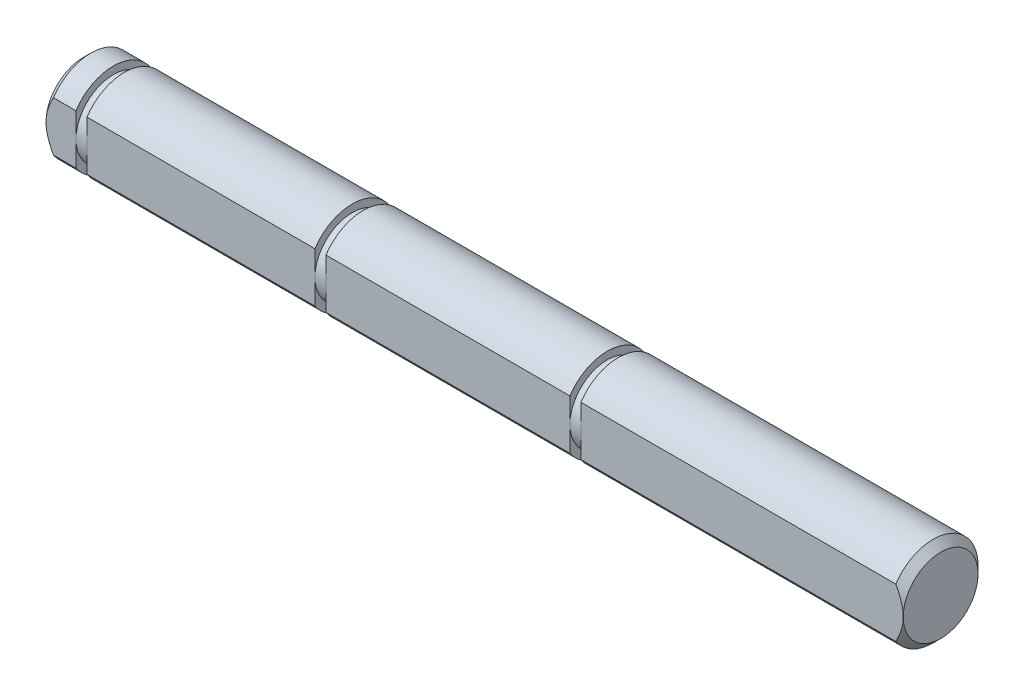
ISO-10303-21;
HEADER;
FILE_DESCRIPTION(('STEP AP214'),'2;1');
FILE_NAME('part.step','',(''),(''),'','','');
FILE_SCHEMA(('AUTOMOTIVE_DESIGN { 1 0 10303 214 1 1 1 1 }'));
ENDSEC;
DATA;
#1=APPLICATION_CONTEXT('core data for automotive mechanical design processes');
#2=APPLICATION_PROTOCOL_DEFINITION('international standard','automotive_design',2000,#1);
#3=PRODUCT_CONTEXT('',#1,'mechanical');
#4=PRODUCT('Part','Part','',(#3));
#5=PRODUCT_RELATED_PRODUCT_CATEGORY('part','',(#4));
#6=PRODUCT_DEFINITION_FORMATION('','',#4);
#7=PRODUCT_DEFINITION_CONTEXT('part definition',#1,'design');
#8=PRODUCT_DEFINITION('design','',#6,#7);
#9=PRODUCT_DEFINITION_SHAPE('','',#8);
#10=(LENGTH_UNIT() NAMED_UNIT(*) SI_UNIT(.MILLI.,.METRE.));
#11=(NAMED_UNIT(*) PLANE_ANGLE_UNIT() SI_UNIT($,.RADIAN.));
#12=(NAMED_UNIT(*) SI_UNIT($,.STERADIAN.) SOLID_ANGLE_UNIT());
#13=UNCERTAINTY_MEASURE_WITH_UNIT(LENGTH_MEASURE(1.E-05),#10,'distance_accuracy_value','');
#14=(GEOMETRIC_REPRESENTATION_CONTEXT(3) GLOBAL_UNCERTAINTY_ASSIGNED_CONTEXT((#13)) GLOBAL_UNIT_ASSIGNED_CONTEXT((#10,
#11,#12)) REPRESENTATION_CONTEXT('',''));
#15=CARTESIAN_POINT('',(0.,0.,0.));
#16=DIRECTION('',(0.,0.,1.));
#17=DIRECTION('',(1.,0.,0.));
#18=AXIS2_PLACEMENT_3D('',#15,#16,#17);
#19=CARTESIAN_POINT('',(-17.9666,0.,0.));
#20=DIRECTION('',(-1.,0.,0.));
#21=DIRECTION('',(0.,0.,1.));
#22=AXIS2_PLACEMENT_3D('',#19,#20,#21);
#23=PLANE('',#22);
#24=CARTESIAN_POINT('',(-17.9666,0.,0.));
#25=DIRECTION('',(-1.,0.,0.));
#26=DIRECTION('',(0.,0.,1.));
#27=AXIS2_PLACEMENT_3D('',#24,#25,#26);
#28=CIRCLE('',#27,2.5);
#29=CARTESIAN_POINT('',(-17.9666,0.,2.5));
#30=VERTEX_POINT('',#29);
#31=EDGE_CURVE('E135',#30,#30,#28,.T.);
#32=ORIENTED_EDGE('',*,*,#31,.T.);
#33=EDGE_LOOP('',(#32));
#34=FACE_BOUND('',#33,.T.);
#35=ADVANCED_FACE('F33',(#34),#23,.T.);
#36=CARTESIAN_POINT('',(-17.9666,0.,0.));
#37=DIRECTION('',(1.,0.,0.));
#38=DIRECTION('',(0.,0.,-1.));
#39=AXIS2_PLACEMENT_3D('',#36,#37,#38);
#40=CYLINDRICAL_SURFACE('',#39,3.);
#41=DIRECTION('',(1.,0.,0.));
#42=VECTOR('',#41,1.);
#43=CARTESIAN_POINT('',(-17.9666,1.6583123951777,2.5));
#44=LINE('',#43,#42);
#45=CARTESIAN_POINT('',(-15.9666,1.6583123951777,2.5));
#46=VERTEX_POINT('',#45);
#47=CARTESIAN_POINT('',(-17.4666,1.6583123951777,2.5));
#48=VERTEX_POINT('',#47);
#49=EDGE_CURVE('E144',#46,#48,#44,.F.);
#50=ORIENTED_EDGE('',*,*,#49,.F.);
#51=CARTESIAN_POINT('',(-15.9666,0.,0.));
#52=DIRECTION('',(1.,0.,0.));
#53=DIRECTION('',(0.,0.,-1.));
#54=AXIS2_PLACEMENT_3D('',#51,#52,#53);
#55=CIRCLE('',#54,3.);
#56=CARTESIAN_POINT('',(-15.9666,-1.6583123951777,2.5));
#57=VERTEX_POINT('',#56);
#58=EDGE_CURVE('E143',#57,#46,#55,.T.);
#59=ORIENTED_EDGE('',*,*,#58,.F.);
#60=DIRECTION('',(1.,0.,0.));
#61=VECTOR('',#60,1.);
#62=CARTESIAN_POINT('',(-17.9666,-1.6583123951777,2.5));
#63=LINE('',#62,#61);
#64=CARTESIAN_POINT('',(-17.4666,-1.6583123951777,2.5));
#65=VERTEX_POINT('',#64);
#66=EDGE_CURVE('E128',#65,#57,#63,.T.);
#67=ORIENTED_EDGE('',*,*,#66,.F.);
#68=CARTESIAN_POINT('',(-17.4666,0.,0.));
#69=DIRECTION('',(-1.,0.,0.));
#70=DIRECTION('',(0.,0.,1.));
#71=AXIS2_PLACEMENT_3D('',#68,#69,#70);
#72=CIRCLE('',#71,3.);
#73=EDGE_CURVE('E141',#65,#48,#72,.F.);
#74=ORIENTED_EDGE('',*,*,#73,.T.);
#75=EDGE_LOOP('',(#50,#59,#67,#74));
#76=FACE_BOUND('',#75,.T.);
#77=ADVANCED_FACE('F140',(#76),#40,.T.);
#78=CARTESIAN_POINT('',(-15.9666,3.,0.));
#79=DIRECTION('',(1.,0.,0.));
#80=DIRECTION('',(0.,0.,-1.));
#81=AXIS2_PLACEMENT_3D('',#78,#79,#80);
#82=PLANE('',#81);
#83=DIRECTION('',(0.,1.,0.));
#84=VECTOR('',#83,1.);
#85=CARTESIAN_POINT('',(-15.9666,3.,2.5));
#86=LINE('',#85,#84);
#87=CARTESIAN_POINT('',(-15.9666,0.,2.5));
#88=VERTEX_POINT('',#87);
#89=EDGE_CURVE('E421',#57,#88,#86,.T.);
#90=ORIENTED_EDGE('',*,*,#89,.F.);
#91=ORIENTED_EDGE('',*,*,#58,.T.);
#92=EDGE_CURVE('E423',#88,#46,#86,.T.);
#93=ORIENTED_EDGE('',*,*,#92,.F.);
#94=CARTESIAN_POINT('',(-15.9666,0.,0.));
#95=DIRECTION('',(1.,0.,0.));
#96=DIRECTION('',(0.,0.,-1.));
#97=AXIS2_PLACEMENT_3D('',#94,#95,#96);
#98=CIRCLE('',#97,2.5);
#99=EDGE_CURVE('E155',#88,#88,#98,.T.);
#100=ORIENTED_EDGE('',*,*,#99,.F.);
#101=EDGE_LOOP('',(#90,#91,#93,#100));
#102=FACE_BOUND('',#101,.T.);
#103=ADVANCED_FACE('F264',(#102),#82,.T.);
#104=CARTESIAN_POINT('',(-17.9666,0.,0.));
#105=DIRECTION('',(1.,0.,0.));
#106=DIRECTION('',(0.,0.,-1.));
#107=AXIS2_PLACEMENT_3D('',#104,#105,#106);
#108=CYLINDRICAL_SURFACE('',#107,2.5);
#109=ORIENTED_EDGE('',*,*,#99,.T.);
#110=EDGE_LOOP('',(#109));
#111=FACE_BOUND('',#110,.T.);
#112=CARTESIAN_POINT('',(-15.23,0.,0.));
#113=DIRECTION('',(1.,0.,0.));
#114=DIRECTION('',(0.,0.,-1.));
#115=AXIS2_PLACEMENT_3D('',#112,#113,#114);
#116=CIRCLE('',#115,2.5);
#117=CARTESIAN_POINT('',(-15.23,0.,2.5));
#118=VERTEX_POINT('',#117);
#119=EDGE_CURVE('E158',#118,#118,#116,.T.);
#120=ORIENTED_EDGE('',*,*,#119,.F.);
#121=EDGE_LOOP('',(#120));
#122=FACE_BOUND('',#121,.T.);
#123=ADVANCED_FACE('F260',(#111,#122),#108,.T.);
#124=CARTESIAN_POINT('',(-15.23,3.,0.));
#125=DIRECTION('',(-1.,0.,0.));
#126=DIRECTION('',(0.,0.,1.));
#127=AXIS2_PLACEMENT_3D('',#124,#125,#126);
#128=PLANE('',#127);
#129=DIRECTION('',(0.,-1.,0.));
#130=VECTOR('',#129,1.);
#131=CARTESIAN_POINT('',(-15.23,3.,2.5));
#132=LINE('',#131,#130);
#133=CARTESIAN_POINT('',(-15.23,1.6583123951777,2.5));
#134=VERTEX_POINT('',#133);
#135=EDGE_CURVE('E188',#134,#118,#132,.T.);
#136=ORIENTED_EDGE('',*,*,#135,.F.);
#137=CARTESIAN_POINT('',(-15.23,0.,0.));
#138=DIRECTION('',(1.,0.,0.));
#139=DIRECTION('',(0.,0.,-1.));
#140=AXIS2_PLACEMENT_3D('',#137,#138,#139);
#141=CIRCLE('',#140,3.);
#142=CARTESIAN_POINT('',(-15.23,-1.6583123951777,2.5));
#143=VERTEX_POINT('',#142);
#144=EDGE_CURVE('E161',#143,#134,#141,.T.);
#145=ORIENTED_EDGE('',*,*,#144,.F.);
#146=EDGE_CURVE('E414',#118,#143,#132,.T.);
#147=ORIENTED_EDGE('',*,*,#146,.F.);
#148=ORIENTED_EDGE('',*,*,#119,.T.);
#149=EDGE_LOOP('',(#136,#145,#147,#148));
#150=FACE_BOUND('',#149,.T.);
#151=ADVANCED_FACE('F256',(#150),#128,.T.);
#152=CARTESIAN_POINT('',(-17.9666,0.,0.));
#153=DIRECTION('',(1.,0.,0.));
#154=DIRECTION('',(0.,0.,-1.));
#155=AXIS2_PLACEMENT_3D('',#152,#153,#154);
#156=CYLINDRICAL_SURFACE('',#155,3.);
#157=DIRECTION('',(1.,0.,0.));
#158=VECTOR('',#157,1.);
#159=CARTESIAN_POINT('',(-17.9666,1.6583123951777,2.5));
#160=LINE('',#159,#158);
#161=CARTESIAN_POINT('',(0.,1.6583123951777,2.5));
#162=VERTEX_POINT('',#161);
#163=EDGE_CURVE('E189',#162,#134,#160,.F.);
#164=ORIENTED_EDGE('',*,*,#163,.F.);
#165=CARTESIAN_POINT('',(0.,0.,0.));
#166=DIRECTION('',(1.,0.,0.));
#167=DIRECTION('',(0.,0.,-1.));
#168=AXIS2_PLACEMENT_3D('',#165,#166,#167);
#169=CIRCLE('',#168,3.);
#170=CARTESIAN_POINT('',(0.,-1.6583123951777,2.5));
#171=VERTEX_POINT('',#170);
#172=EDGE_CURVE('E164',#171,#162,#169,.T.);
#173=ORIENTED_EDGE('',*,*,#172,.F.);
#174=DIRECTION('',(1.,0.,0.));
#175=VECTOR('',#174,1.);
#176=CARTESIAN_POINT('',(-17.9666,-1.6583123951777,2.5));
#177=LINE('',#176,#175);
#178=EDGE_CURVE('E420',#143,#171,#177,.T.);
#179=ORIENTED_EDGE('',*,*,#178,.F.);
#180=ORIENTED_EDGE('',*,*,#144,.T.);
#181=EDGE_LOOP('',(#164,#173,#179,#180));
#182=FACE_BOUND('',#181,.T.);
#183=ADVANCED_FACE('F252',(#182),#156,.T.);
#184=CARTESIAN_POINT('',(0.,3.,0.));
#185=DIRECTION('',(1.,0.,0.));
#186=DIRECTION('',(0.,0.,-1.));
#187=AXIS2_PLACEMENT_3D('',#184,#185,#186);
#188=PLANE('',#187);
#189=DIRECTION('',(0.,1.,0.));
#190=VECTOR('',#189,1.);
#191=CARTESIAN_POINT('',(0.,3.,2.5));
#192=LINE('',#191,#190);
#193=CARTESIAN_POINT('',(0.,0.,2.5));
#194=VERTEX_POINT('',#193);
#195=EDGE_CURVE('E54',#171,#194,#192,.T.);
#196=ORIENTED_EDGE('',*,*,#195,.F.);
#197=ORIENTED_EDGE('',*,*,#172,.T.);
#198=EDGE_CURVE('E191',#194,#162,#192,.T.);
#199=ORIENTED_EDGE('',*,*,#198,.F.);
#200=CARTESIAN_POINT('',(0.,0.,0.));
#201=DIRECTION('',(1.,0.,0.));
#202=DIRECTION('',(0.,0.,-1.));
#203=AXIS2_PLACEMENT_3D('',#200,#201,#202);
#204=CIRCLE('',#203,2.5);
#205=EDGE_CURVE('E167',#194,#194,#204,.T.);
#206=ORIENTED_EDGE('',*,*,#205,.F.);
#207=EDGE_LOOP('',(#196,#197,#199,#206));
#208=FACE_BOUND('',#207,.T.);
#209=ADVANCED_FACE('F248',(#208),#188,.T.);
#210=CARTESIAN_POINT('',(-17.9666,0.,0.));
#211=DIRECTION('',(1.,0.,0.));
#212=DIRECTION('',(0.,0.,-1.));
#213=AXIS2_PLACEMENT_3D('',#210,#211,#212);
#214=CYLINDRICAL_SURFACE('',#213,2.5);
#215=ORIENTED_EDGE('',*,*,#205,.T.);
#216=EDGE_LOOP('',(#215));
#217=FACE_BOUND('',#216,.T.);
#218=CARTESIAN_POINT('',(0.7366,0.,0.));
#219=DIRECTION('',(1.,0.,0.));
#220=DIRECTION('',(0.,0.,-1.));
#221=AXIS2_PLACEMENT_3D('',#218,#219,#220);
#222=CIRCLE('',#221,2.5);
#223=CARTESIAN_POINT('',(0.7366,0.,2.5));
#224=VERTEX_POINT('',#223);
#225=EDGE_CURVE('E170',#224,#224,#222,.T.);
#226=ORIENTED_EDGE('',*,*,#225,.F.);
#227=EDGE_LOOP('',(#226));
#228=FACE_BOUND('',#227,.T.);
#229=ADVANCED_FACE('F244',(#217,#228),#214,.T.);
#230=CARTESIAN_POINT('',(0.7366,3.,0.));
#231=DIRECTION('',(-1.,0.,0.));
#232=DIRECTION('',(0.,0.,1.));
#233=AXIS2_PLACEMENT_3D('',#230,#231,#232);
#234=PLANE('',#233);
#235=DIRECTION('',(0.,-1.,0.));
#236=VECTOR('',#235,1.);
#237=CARTESIAN_POINT('',(0.7366,3.,2.5));
#238=LINE('',#237,#236);
#239=CARTESIAN_POINT('',(0.7366,1.6583123951777,2.5));
#240=VERTEX_POINT('',#239);
#241=EDGE_CURVE('E194',#240,#224,#238,.T.);
#242=ORIENTED_EDGE('',*,*,#241,.F.);
#243=CARTESIAN_POINT('',(0.7366,0.,0.));
#244=DIRECTION('',(1.,0.,0.));
#245=DIRECTION('',(0.,0.,-1.));
#246=AXIS2_PLACEMENT_3D('',#243,#244,#245);
#247=CIRCLE('',#246,3.);
#248=CARTESIAN_POINT('',(0.7366,-1.6583123951777,2.5));
#249=VERTEX_POINT('',#248);
#250=EDGE_CURVE('E173',#249,#240,#247,.T.);
#251=ORIENTED_EDGE('',*,*,#250,.F.);
#252=EDGE_CURVE('E428',#224,#249,#238,.T.);
#253=ORIENTED_EDGE('',*,*,#252,.F.);
#254=ORIENTED_EDGE('',*,*,#225,.T.);
#255=EDGE_LOOP('',(#242,#251,#253,#254));
#256=FACE_BOUND('',#255,.T.);
#257=ADVANCED_FACE('F240',(#256),#234,.T.);
#258=CARTESIAN_POINT('',(-17.9666,0.,0.));
#259=DIRECTION('',(1.,0.,0.));
#260=DIRECTION('',(0.,0.,-1.));
#261=AXIS2_PLACEMENT_3D('',#258,#259,#260);
#262=CYLINDRICAL_SURFACE('',#261,3.);
#263=DIRECTION('',(1.,0.,0.));
#264=VECTOR('',#263,1.);
#265=CARTESIAN_POINT('',(-17.9666,1.6583123951777,2.5));
#266=LINE('',#265,#264);
#267=CARTESIAN_POINT('',(17.0366,1.6583123951777,2.5));
#268=VERTEX_POINT('',#267);
#269=EDGE_CURVE('E192',#268,#240,#266,.F.);
#270=ORIENTED_EDGE('',*,*,#269,.F.);
#271=CARTESIAN_POINT('',(17.0366,0.,0.));
#272=DIRECTION('',(1.,0.,0.));
#273=DIRECTION('',(0.,0.,-1.));
#274=AXIS2_PLACEMENT_3D('',#271,#272,#273);
#275=CIRCLE('',#274,3.);
#276=CARTESIAN_POINT('',(17.0366,-1.6583123951777,2.5));
#277=VERTEX_POINT('',#276);
#278=EDGE_CURVE('E176',#277,#268,#275,.T.);
#279=ORIENTED_EDGE('',*,*,#278,.F.);
#280=DIRECTION('',(1.,0.,0.));
#281=VECTOR('',#280,1.);
#282=CARTESIAN_POINT('',(-17.9666,-1.6583123951777,2.5));
#283=LINE('',#282,#281);
#284=EDGE_CURVE('E430',#249,#277,#283,.T.);
#285=ORIENTED_EDGE('',*,*,#284,.F.);
#286=ORIENTED_EDGE('',*,*,#250,.T.);
#287=EDGE_LOOP('',(#270,#279,#285,#286));
#288=FACE_BOUND('',#287,.T.);
#289=ADVANCED_FACE('F236',(#288),#262,.T.);
#290=CARTESIAN_POINT('',(17.0366,3.,0.));
#291=DIRECTION('',(1.,0.,0.));
#292=DIRECTION('',(0.,0.,-1.));
#293=AXIS2_PLACEMENT_3D('',#290,#291,#292);
#294=PLANE('',#293);
#295=DIRECTION('',(0.,1.,0.));
#296=VECTOR('',#295,1.);
#297=CARTESIAN_POINT('',(17.0366,3.,2.5));
#298=LINE('',#297,#296);
#299=CARTESIAN_POINT('',(17.0366,0.,2.5));
#300=VERTEX_POINT('',#299);
#301=EDGE_CURVE('E62',#277,#300,#298,.T.);
#302=ORIENTED_EDGE('',*,*,#301,.F.);
#303=ORIENTED_EDGE('',*,*,#278,.T.);
#304=EDGE_CURVE('E195',#300,#268,#298,.T.);
#305=ORIENTED_EDGE('',*,*,#304,.F.);
#306=CARTESIAN_POINT('',(17.0366,0.,0.));
#307=DIRECTION('',(1.,0.,0.));
#308=DIRECTION('',(0.,0.,-1.));
#309=AXIS2_PLACEMENT_3D('',#306,#307,#308);
#310=CIRCLE('',#309,2.5);
#311=EDGE_CURVE('E179',#300,#300,#310,.T.);
#312=ORIENTED_EDGE('',*,*,#311,.F.);
#313=EDGE_LOOP('',(#302,#303,#305,#312));
#314=FACE_BOUND('',#313,.T.);
#315=ADVANCED_FACE('F232',(#314),#294,.T.);
#316=CARTESIAN_POINT('',(-17.9666,0.,0.));
#317=DIRECTION('',(1.,0.,0.));
#318=DIRECTION('',(0.,0.,-1.));
#319=AXIS2_PLACEMENT_3D('',#316,#317,#318);
#320=CYLINDRICAL_SURFACE('',#319,2.5);
#321=ORIENTED_EDGE('',*,*,#311,.T.);
#322=EDGE_LOOP('',(#321));
#323=FACE_BOUND('',#322,.T.);
#324=CARTESIAN_POINT('',(17.7732,0.,0.));
#325=DIRECTION('',(1.,0.,0.));
#326=DIRECTION('',(0.,0.,-1.));
#327=AXIS2_PLACEMENT_3D('',#324,#325,#326);
#328=CIRCLE('',#327,2.5);
#329=CARTESIAN_POINT('',(17.7732,0.,2.5));
#330=VERTEX_POINT('',#329);
#331=EDGE_CURVE('E182',#330,#330,#328,.T.);
#332=ORIENTED_EDGE('',*,*,#331,.F.);
#333=EDGE_LOOP('',(#332));
#334=FACE_BOUND('',#333,.T.);
#335=ADVANCED_FACE('F228',(#323,#334),#320,.T.);
#336=CARTESIAN_POINT('',(17.7732,3.,0.));
#337=DIRECTION('',(-1.,0.,0.));
#338=DIRECTION('',(0.,0.,1.));
#339=AXIS2_PLACEMENT_3D('',#336,#337,#338);
#340=PLANE('',#339);
#341=DIRECTION('',(0.,-1.,0.));
#342=VECTOR('',#341,1.);
#343=CARTESIAN_POINT('',(17.7732,3.,2.5));
#344=LINE('',#343,#342);
#345=CARTESIAN_POINT('',(17.7732,1.6583123951777,2.5));
#346=VERTEX_POINT('',#345);
#347=EDGE_CURVE('E198',#346,#330,#344,.T.);
#348=ORIENTED_EDGE('',*,*,#347,.F.);
#349=CARTESIAN_POINT('',(17.7732,0.,0.));
#350=DIRECTION('',(1.,0.,0.));
#351=DIRECTION('',(0.,0.,-1.));
#352=AXIS2_PLACEMENT_3D('',#349,#350,#351);
#353=CIRCLE('',#352,3.);
#354=CARTESIAN_POINT('',(17.7732,-1.6583123951777,2.5));
#355=VERTEX_POINT('',#354);
#356=EDGE_CURVE('E185',#355,#346,#353,.T.);
#357=ORIENTED_EDGE('',*,*,#356,.F.);
#358=EDGE_CURVE('E432',#330,#355,#344,.T.);
#359=ORIENTED_EDGE('',*,*,#358,.F.);
#360=ORIENTED_EDGE('',*,*,#331,.T.);
#361=EDGE_LOOP('',(#348,#357,#359,#360));
#362=FACE_BOUND('',#361,.T.);
#363=ADVANCED_FACE('F224',(#362),#340,.T.);
#364=CARTESIAN_POINT('',(-17.9666,0.,0.));
#365=DIRECTION('',(1.,0.,0.));
#366=DIRECTION('',(0.,0.,-1.));
#367=AXIS2_PLACEMENT_3D('',#364,#365,#366);
#368=CYLINDRICAL_SURFACE('',#367,3.);
#369=DIRECTION('',(1.,0.,0.));
#370=VECTOR('',#369,1.);
#371=CARTESIAN_POINT('',(-17.9666,1.6583123951777,2.5));
#372=LINE('',#371,#370);
#373=CARTESIAN_POINT('',(38.8098,1.6583123951777,2.5));
#374=VERTEX_POINT('',#373);
#375=EDGE_CURVE('E196',#374,#346,#372,.F.);
#376=ORIENTED_EDGE('',*,*,#375,.F.);
#377=CARTESIAN_POINT('',(38.8098,0.,0.));
#378=DIRECTION('',(1.,0.,0.));
#379=DIRECTION('',(0.,0.,-1.));
#380=AXIS2_PLACEMENT_3D('',#377,#378,#379);
#381=CIRCLE('',#380,3.);
#382=CARTESIAN_POINT('',(38.8098,-1.6583123951777,2.5));
#383=VERTEX_POINT('',#382);
#384=EDGE_CURVE('E146',#374,#383,#381,.F.);
#385=ORIENTED_EDGE('',*,*,#384,.T.);
#386=DIRECTION('',(1.,0.,0.));
#387=VECTOR('',#386,1.);
#388=CARTESIAN_POINT('',(-17.9666,-1.6583123951777,2.5));
#389=LINE('',#388,#387);
#390=EDGE_CURVE('E206',#355,#383,#389,.T.);
#391=ORIENTED_EDGE('',*,*,#390,.F.);
#392=ORIENTED_EDGE('',*,*,#356,.T.);
#393=EDGE_LOOP('',(#376,#385,#391,#392));
#394=FACE_BOUND('',#393,.T.);
#395=ADVANCED_FACE('F220',(#394),#368,.T.);
#396=CARTESIAN_POINT('',(39.3098,0.,0.));
#397=DIRECTION('',(1.,0.,0.));
#398=DIRECTION('',(0.,0.,-1.));
#399=AXIS2_PLACEMENT_3D('',#396,#397,#398);
#400=PLANE('',#399);
#401=CARTESIAN_POINT('',(39.3098,0.,0.));
#402=DIRECTION('',(1.,0.,0.));
#403=DIRECTION('',(0.,0.,-1.));
#404=AXIS2_PLACEMENT_3D('',#401,#402,#403);
#405=CIRCLE('',#404,2.49999999999999);
#406=CARTESIAN_POINT('',(39.3098,0.,2.49999999999999));
#407=VERTEX_POINT('',#406);
#408=EDGE_CURVE('E149',#407,#407,#405,.T.);
#409=ORIENTED_EDGE('',*,*,#408,.T.);
#410=EDGE_LOOP('',(#409));
#411=FACE_BOUND('',#410,.T.);
#412=ADVANCED_FACE('F216',(#411),#400,.T.);
#413=CARTESIAN_POINT('',(39.3098,0.,0.));
#414=DIRECTION('',(-1.,0.,0.));
#415=DIRECTION('',(0.,0.,1.));
#416=AXIS2_PLACEMENT_3D('',#413,#414,#415);
#417=CONICAL_SURFACE('',#416,2.49999999999999,0.785398163397446);
#418=CARTESIAN_POINT('',(36.3056289096664,-4.90366183496212,2.5));
#419=CARTESIAN_POINT('',(36.406342976222,-4.79059675295587,2.5));
#420=CARTESIAN_POINT('',(36.5066745735829,-4.67718774690958,2.5));
#421=CARTESIAN_POINT('',(36.7063687128676,-4.44949963939303,2.5));
#422=CARTESIAN_POINT('',(36.8057311541058,-4.33522044967003,2.5));
#423=CARTESIAN_POINT('',(37.0036765483358,-4.10515115976602,2.5));
#424=CARTESIAN_POINT('',(37.1022544801874,-3.98935673151278,2.5));
#425=CARTESIAN_POINT('',(37.297893226199,-3.75650026400503,2.5));
#426=CARTESIAN_POINT('',(37.3949541110093,-3.63943828421393,2.5));
#427=CARTESIAN_POINT('',(37.5929145884509,-3.39666879549023,2.5));
#428=CARTESIAN_POINT('',(37.6936951479638,-3.27086393394356,2.5));
#429=CARTESIAN_POINT('',(37.8923886568239,-3.01701189664735,2.5));
#430=CARTESIAN_POINT('',(37.9903017829648,-2.88896485992191,2.5));
#431=CARTESIAN_POINT('',(38.1820774108402,-2.63019247899487,2.5));
#432=CARTESIAN_POINT('',(38.2759464535075,-2.49947200597043,2.5));
#433=CARTESIAN_POINT('',(38.4582522093509,-2.23431628378316,2.5));
#434=CARTESIAN_POINT('',(38.5466908040468,-2.09988234492143,2.5));
#435=CARTESIAN_POINT('',(38.6907175521706,-1.8666534315385,2.5));
#436=CARTESIAN_POINT('',(38.7482820346469,-1.76908510627459,2.5));
#437=CARTESIAN_POINT('',(38.8582988846602,-1.57103442613002,2.5));
#438=CARTESIAN_POINT('',(38.910749603831,-1.47055114509874,2.5));
#439=CARTESIAN_POINT('',(39.0084054832375,-1.26716191797306,2.5));
#440=CARTESIAN_POINT('',(39.0536698313462,-1.16428473472154,2.5));
#441=CARTESIAN_POINT('',(39.1353139846091,-0.9550529388449,2.5));
#442=CARTESIAN_POINT('',(39.1716997163794,-0.848700699940286,2.5));
#443=CARTESIAN_POINT('',(39.2230561397099,-0.667918776276506,2.5));
#444=CARTESIAN_POINT('',(39.2411417923297,-0.594375466872452,2.5));
#445=CARTESIAN_POINT('',(39.2713533496076,-0.446066762912177,2.5));
#446=CARTESIAN_POINT('',(39.2834802832231,-0.371301581655517,2.5));
#447=CARTESIAN_POINT('',(39.3011299049196,-0.221254321150891,2.5));
#448=CARTESIAN_POINT('',(39.3066759209346,-0.145975024858447,2.5));
#449=CARTESIAN_POINT('',(39.3109308833489,0.00478037196678508,2.5));
#450=CARTESIAN_POINT('',(39.3096398127324,0.0802564729889046,2.5));
#451=CARTESIAN_POINT('',(39.3003180914433,0.230410617130039,2.5));
#452=CARTESIAN_POINT('',(39.2923206838189,0.305090760119727,2.5));
#453=CARTESIAN_POINT('',(39.2700585226377,0.453514642713049,2.5));
#454=CARTESIAN_POINT('',(39.2557922816627,0.527258155805472,2.5));
#455=CARTESIAN_POINT('',(39.2214714042455,0.674250690828724,2.5));
#456=CARTESIAN_POINT('',(39.2013530031003,0.747484638441745,2.5));
#457=CARTESIAN_POINT('',(39.1561967490751,0.892385117126692,2.5));
#458=CARTESIAN_POINT('',(39.1311598046722,0.964051934942017,2.5));
#459=CARTESIAN_POINT('',(39.0679633572193,1.12928116798483,2.5));
#460=CARTESIAN_POINT('',(39.0282047094974,1.22222916666879,2.5));
#461=CARTESIAN_POINT('',(38.9429573381258,1.40547920908523,2.5));
#462=CARTESIAN_POINT('',(38.8974654727615,1.49577976836249,2.5));
#463=CARTESIAN_POINT('',(38.8018732558428,1.67431385608274,2.5));
#464=CARTESIAN_POINT('',(38.7517566581041,1.7625386168896,2.5));
#465=CARTESIAN_POINT('',(38.6480556593405,1.93688820590342,2.5));
#466=CARTESIAN_POINT('',(38.5944719317153,2.02301343744225,2.5));
#467=CARTESIAN_POINT('',(38.487309386678,2.18924058488941,2.5));
#468=CARTESIAN_POINT('',(38.4338635754693,2.26942869467956,2.5));
#469=CARTESIAN_POINT('',(38.3249775879617,2.42844442134662,2.5));
#470=CARTESIAN_POINT('',(38.2695372518433,2.50727192844735,2.5));
#471=CARTESIAN_POINT('',(38.1575369670973,2.66306918553884,2.5));
#472=CARTESIAN_POINT('',(38.1009912433032,2.74004919698303,2.5));
#473=CARTESIAN_POINT('',(37.9865931522674,2.89300140530801,2.5));
#474=CARTESIAN_POINT('',(37.9287411356053,2.96897386410572,2.5));
#475=CARTESIAN_POINT('',(37.8703616796466,3.04453186547109,2.5));
#476=B_SPLINE_CURVE_WITH_KNOTS('',3,(#418,#419,#420,#421,#422,#423,#424,#425,#426,#427,#428,
#429,#430,#431,#432,#433,#434,#435,#436,#437,#438,#439,#440,#441,#442,#443,#444,#445,#446,#447,
#448,#449,#450,#451,#452,#453,#454,#455,#456,#457,#458,#459,#460,#461,#462,#463,#464,#465,#466,
#467,#468,#469,#470,#471,#472,#473,#474,#475),.UNSPECIFIED.,.F.,.F.,(4,2,2,2,2,2,2,2,2,2,2,2,2,
2,2,2,2,2,2,2,2,2,2,2,2,2,2,2,4),(0.,0.454253017040979,0.908552734196463,1.36475897197665,
1.82094390013501,2.30449620818369,2.78801863942186,3.27072716340936,3.75326748562994,
4.09300641778835,4.43285450154081,4.7697393854939,5.10639877451157,5.3333932993417,
5.56034861275442,5.78649699203182,6.01264593413693,6.23768044628144,6.46276838165776,
6.69040712034917,6.91800385260736,7.22102383488957,7.52421059539233,7.82850620507007,
8.13274288961359,8.42180800638351,8.71089633751179,8.99742981060107,9.2838872776559),.UNSPECIFIED.);
#477=EDGE_CURVE('E200',#383,#407,#476,.T.);
#478=ORIENTED_EDGE('',*,*,#477,.F.);
#479=ORIENTED_EDGE('',*,*,#384,.F.);
#480=EDGE_CURVE('E199',#407,#374,#476,.T.);
#481=ORIENTED_EDGE('',*,*,#480,.F.);
#482=ORIENTED_EDGE('',*,*,#408,.F.);
#483=EDGE_LOOP('',(#478,#479,#481,#482));
#484=FACE_BOUND('',#483,.T.);
#485=ADVANCED_FACE('F208',(#484),#417,.T.);
#486=CARTESIAN_POINT('',(-17.4666,0.,0.));
#487=DIRECTION('',(1.,0.,0.));
#488=DIRECTION('',(0.,0.,-1.));
#489=AXIS2_PLACEMENT_3D('',#486,#487,#488);
#490=CONICAL_SURFACE('',#489,3.,0.785398163397453);
#491=CARTESIAN_POINT('',(-14.9624289096664,-4.90366183496212,2.5));
#492=CARTESIAN_POINT('',(-15.063142976222,-4.79059675295588,2.5));
#493=CARTESIAN_POINT('',(-15.1634745735829,-4.67718774690958,2.5));
#494=CARTESIAN_POINT('',(-15.3631687128676,-4.44949963939303,2.5));
#495=CARTESIAN_POINT('',(-15.4625311541059,-4.33522044967004,2.5));
#496=CARTESIAN_POINT('',(-15.6604765483358,-4.10515115976603,2.5));
#497=CARTESIAN_POINT('',(-15.7590544801874,-3.98935673151278,2.5));
#498=CARTESIAN_POINT('',(-15.9546932261991,-3.75650026400504,2.5));
#499=CARTESIAN_POINT('',(-16.0517541110093,-3.63943828421393,2.5));
#500=CARTESIAN_POINT('',(-16.2497145884509,-3.39666879549023,2.5));
#501=CARTESIAN_POINT('',(-16.3504951479638,-3.27086393394356,2.5));
#502=CARTESIAN_POINT('',(-16.5491886568239,-3.01701189664735,2.5));
#503=CARTESIAN_POINT('',(-16.6471017829648,-2.88896485992191,2.5));
#504=CARTESIAN_POINT('',(-16.8388774108402,-2.63019247899488,2.5));
#505=CARTESIAN_POINT('',(-16.9327464535075,-2.49947200597043,2.5));
#506=CARTESIAN_POINT('',(-17.1150522093509,-2.23431628378316,2.5));
#507=CARTESIAN_POINT('',(-17.2034908040468,-2.09988234492144,2.5));
#508=CARTESIAN_POINT('',(-17.3475175521706,-1.86665343153851,2.5));
#509=CARTESIAN_POINT('',(-17.4050820346469,-1.76908510627459,2.5));
#510=CARTESIAN_POINT('',(-17.5150988846602,-1.57103442613002,2.5));
#511=CARTESIAN_POINT('',(-17.567549603831,-1.47055114509874,2.5));
#512=CARTESIAN_POINT('',(-17.6652054832375,-1.26716191797306,2.5));
#513=CARTESIAN_POINT('',(-17.7104698313462,-1.16428473472154,2.5));
#514=CARTESIAN_POINT('',(-17.7921139846091,-0.955052938844893,2.5));
#515=CARTESIAN_POINT('',(-17.8284997163794,-0.848700699940275,2.5));
#516=CARTESIAN_POINT('',(-17.8798561397099,-0.667918776276491,2.5));
#517=CARTESIAN_POINT('',(-17.8979417923297,-0.594375466872437,2.5));
#518=CARTESIAN_POINT('',(-17.9281533496076,-0.44606676291216,2.5));
#519=CARTESIAN_POINT('',(-17.9402802832231,-0.371301581655499,2.5));
#520=CARTESIAN_POINT('',(-17.9579299049196,-0.221254321150871,2.5));
#521=CARTESIAN_POINT('',(-17.9634759209346,-0.145975024858426,2.5));
#522=CARTESIAN_POINT('',(-17.9677308833489,0.00478037196680828,2.5));
#523=CARTESIAN_POINT('',(-17.9664398127323,0.0802564729889286,2.5));
#524=CARTESIAN_POINT('',(-17.9571180914432,0.230410617130065,2.5));
#525=CARTESIAN_POINT('',(-17.9491206838188,0.305090760119755,2.5));
#526=CARTESIAN_POINT('',(-17.9268585226377,0.453514642713079,2.5));
#527=CARTESIAN_POINT('',(-17.9125922816627,0.527258155805502,2.5));
#528=CARTESIAN_POINT('',(-17.8782714042455,0.674250690828754,2.5));
#529=CARTESIAN_POINT('',(-17.8581530031002,0.747484638441775,2.5));
#530=CARTESIAN_POINT('',(-17.8129967490751,0.892385117126724,2.5));
#531=CARTESIAN_POINT('',(-17.7879598046722,0.964051934942051,2.5));
#532=CARTESIAN_POINT('',(-17.7247633572193,1.12928116798487,2.5));
#533=CARTESIAN_POINT('',(-17.6850047094973,1.22222916666883,2.5));
#534=CARTESIAN_POINT('',(-17.5997573381257,1.40547920908528,2.5));
#535=CARTESIAN_POINT('',(-17.5542654727615,1.49577976836255,2.5));
#536=CARTESIAN_POINT('',(-17.4586732558427,1.6743138560828,2.5));
#537=CARTESIAN_POINT('',(-17.4085566581041,1.76253861688968,2.5));
#538=CARTESIAN_POINT('',(-17.3048556593404,1.9368882059035,2.5));
#539=CARTESIAN_POINT('',(-17.2512719317153,2.02301343744234,2.5));
#540=CARTESIAN_POINT('',(-17.144109386678,2.1892405848895,2.5));
#541=CARTESIAN_POINT('',(-17.0906635754692,2.26942869467966,2.5));
#542=CARTESIAN_POINT('',(-16.9817775879617,2.42844442134673,2.5));
#543=CARTESIAN_POINT('',(-16.9263372518433,2.50727192844747,2.5));
#544=CARTESIAN_POINT('',(-16.8143369670972,2.66306918553896,2.5));
#545=CARTESIAN_POINT('',(-16.7577912433031,2.74004919698315,2.5));
#546=CARTESIAN_POINT('',(-16.6433931522673,2.89300140530814,2.5));
#547=CARTESIAN_POINT('',(-16.5855411356052,2.96897386410586,2.5));
#548=CARTESIAN_POINT('',(-16.5271616796465,3.04453186547123,2.5));
#549=B_SPLINE_CURVE_WITH_KNOTS('',3,(#491,#492,#493,#494,#495,#496,#497,#498,#499,#500,#501,
#502,#503,#504,#505,#506,#507,#508,#509,#510,#511,#512,#513,#514,#515,#516,#517,#518,#519,#520,
#521,#522,#523,#524,#525,#526,#527,#528,#529,#530,#531,#532,#533,#534,#535,#536,#537,#538,#539,
#540,#541,#542,#543,#544,#545,#546,#547,#548),.UNSPECIFIED.,.F.,.F.,(4,2,2,2,2,2,2,2,2,2,2,2,2,
2,2,2,2,2,2,2,2,2,2,2,2,2,2,2,4),(0.,0.454253017040977,0.908552734196459,1.36475897197664,
1.820943900135,2.30449620818368,2.78801863942185,3.27072716340935,3.75326748562992,
4.09300641778833,4.43285450154079,4.76973938549389,5.10639877451157,5.33339329934171,
5.56034861275442,5.78649699203182,6.01264593413694,6.23768044628145,6.46276838165778,
6.69040712034918,6.91800385260738,7.22102383488961,7.52421059539239,7.82850620507014,
8.13274288961368,8.42180800638362,8.71089633751191,8.9974298106012,9.28388727765606),.UNSPECIFIED.);
#550=EDGE_CURVE('E11',#48,#30,#549,.F.);
#551=ORIENTED_EDGE('',*,*,#550,.F.);
#552=ORIENTED_EDGE('',*,*,#73,.F.);
#553=EDGE_CURVE('E38',#30,#65,#549,.F.);
#554=ORIENTED_EDGE('',*,*,#553,.F.);
#555=ORIENTED_EDGE('',*,*,#31,.F.);
#556=EDGE_LOOP('',(#551,#552,#554,#555));
#557=FACE_BOUND('',#556,.T.);
#558=ADVANCED_FACE('F35',(#557),#490,.T.);
#559=CARTESIAN_POINT('',(-17.9666,3.,2.5));
#560=DIRECTION('',(0.,0.,-1.));
#561=DIRECTION('',(-1.,0.,0.));
#562=AXIS2_PLACEMENT_3D('',#559,#560,#561);
#563=PLANE('',#562);
#564=ORIENTED_EDGE('',*,*,#89,.T.);
#565=ORIENTED_EDGE('',*,*,#92,.T.);
#566=ORIENTED_EDGE('',*,*,#49,.T.);
#567=ORIENTED_EDGE('',*,*,#550,.T.);
#568=ORIENTED_EDGE('',*,*,#553,.T.);
#569=ORIENTED_EDGE('',*,*,#66,.T.);
#570=EDGE_LOOP('',(#564,#565,#566,#567,#568,#569));
#571=FACE_BOUND('',#570,.T.);
#572=ADVANCED_FACE('F127',(#571),#563,.F.);
#573=ORIENTED_EDGE('',*,*,#347,.T.);
#574=ORIENTED_EDGE('',*,*,#358,.T.);
#575=ORIENTED_EDGE('',*,*,#390,.T.);
#576=ORIENTED_EDGE('',*,*,#477,.T.);
#577=ORIENTED_EDGE('',*,*,#480,.T.);
#578=ORIENTED_EDGE('',*,*,#375,.T.);
#579=EDGE_LOOP('',(#573,#574,#575,#576,#577,#578));
#580=FACE_BOUND('',#579,.T.);
#581=ADVANCED_FACE('F214',(#580),#563,.F.);
#582=ORIENTED_EDGE('',*,*,#241,.T.);
#583=ORIENTED_EDGE('',*,*,#252,.T.);
#584=ORIENTED_EDGE('',*,*,#284,.T.);
#585=ORIENTED_EDGE('',*,*,#301,.T.);
#586=ORIENTED_EDGE('',*,*,#304,.T.);
#587=ORIENTED_EDGE('',*,*,#269,.T.);
#588=EDGE_LOOP('',(#582,#583,#584,#585,#586,#587));
#589=FACE_BOUND('',#588,.T.);
#590=ADVANCED_FACE('F351',(#589),#563,.F.);
#591=ORIENTED_EDGE('',*,*,#135,.T.);
#592=ORIENTED_EDGE('',*,*,#146,.T.);
#593=ORIENTED_EDGE('',*,*,#178,.T.);
#594=ORIENTED_EDGE('',*,*,#195,.T.);
#595=ORIENTED_EDGE('',*,*,#198,.T.);
#596=ORIENTED_EDGE('',*,*,#163,.T.);
#597=EDGE_LOOP('',(#591,#592,#593,#594,#595,#596));
#598=FACE_BOUND('',#597,.T.);
#599=ADVANCED_FACE('F215',(#598),#563,.F.);
#600=CLOSED_SHELL('',(#35,#77,#103,#123,#151,#183,#209,#229,#257,#289,#315,#335,#363,#395,#412,
#485,#558,#572,#581,#590,#599));
#601=MANIFOLD_SOLID_BREP('B2',#600);
#602=ADVANCED_BREP_SHAPE_REPRESENTATION('',(#18,#601),#14);
#603=SHAPE_DEFINITION_REPRESENTATION(#9,#602);
ENDSEC;
END-ISO-10303-21;
